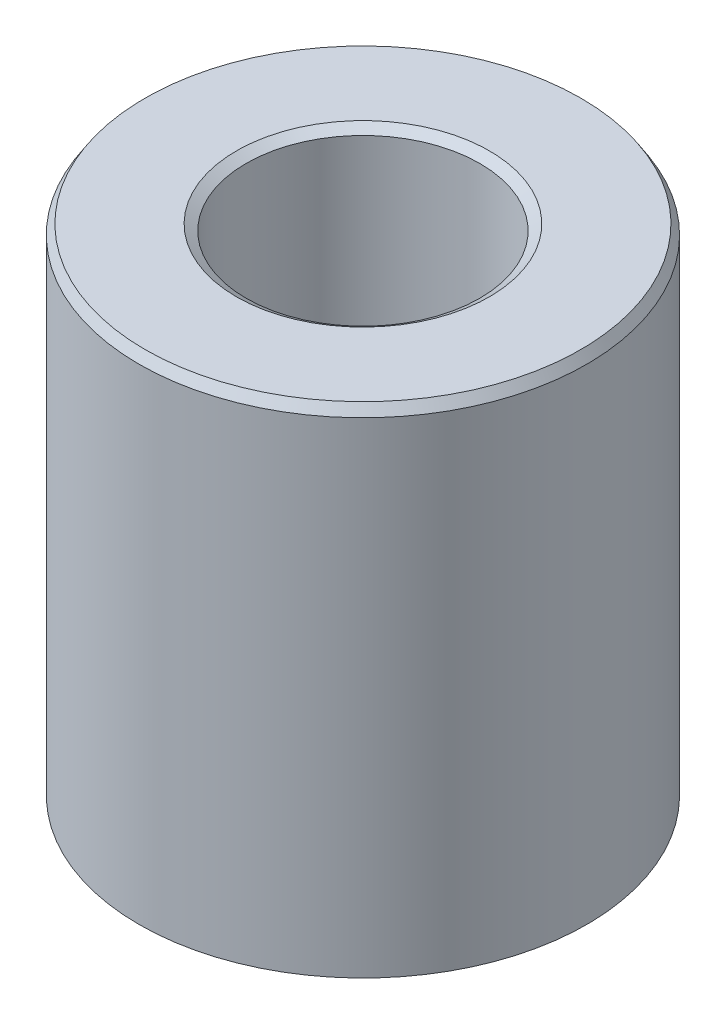
ISO-10303-21;
HEADER;
FILE_DESCRIPTION(('STEP AP214'),'2;1');
FILE_NAME('part.step','',(''),(''),'','','');
FILE_SCHEMA(('AUTOMOTIVE_DESIGN { 1 0 10303 214 1 1 1 1 }'));
ENDSEC;
DATA;
#1=APPLICATION_CONTEXT('core data for automotive mechanical design processes');
#2=APPLICATION_PROTOCOL_DEFINITION('international standard','automotive_design',2000,#1);
#3=PRODUCT_CONTEXT('',#1,'mechanical');
#4=PRODUCT('Part','Part','',(#3));
#5=PRODUCT_RELATED_PRODUCT_CATEGORY('part','',(#4));
#6=PRODUCT_DEFINITION_FORMATION('','',#4);
#7=PRODUCT_DEFINITION_CONTEXT('part definition',#1,'design');
#8=PRODUCT_DEFINITION('design','',#6,#7);
#9=PRODUCT_DEFINITION_SHAPE('','',#8);
#10=(LENGTH_UNIT() NAMED_UNIT(*) SI_UNIT(.MILLI.,.METRE.));
#11=(NAMED_UNIT(*) PLANE_ANGLE_UNIT() SI_UNIT($,.RADIAN.));
#12=(NAMED_UNIT(*) SI_UNIT($,.STERADIAN.) SOLID_ANGLE_UNIT());
#13=UNCERTAINTY_MEASURE_WITH_UNIT(LENGTH_MEASURE(1.E-05),#10,'distance_accuracy_value','');
#14=(GEOMETRIC_REPRESENTATION_CONTEXT(3) GLOBAL_UNCERTAINTY_ASSIGNED_CONTEXT((#13)) GLOBAL_UNIT_ASSIGNED_CONTEXT((#10,
#11,#12)) REPRESENTATION_CONTEXT('',''));
#15=CARTESIAN_POINT('',(0.,0.,0.));
#16=DIRECTION('',(0.,0.,1.));
#17=DIRECTION('',(1.,0.,0.));
#18=AXIS2_PLACEMENT_3D('',#15,#16,#17);
#19=CARTESIAN_POINT('',(0.,111.864383192413,0.));
#20=DIRECTION('',(0.,-1.,0.));
#21=DIRECTION('',(0.,0.,-1.));
#22=AXIS2_PLACEMENT_3D('',#19,#20,#21);
#23=CYLINDRICAL_SURFACE('',#22,50.);
#24=CARTESIAN_POINT('',(0.,1.3553874074811,0.));
#25=DIRECTION('',(0.,1.,0.));
#26=DIRECTION('',(0.,0.,1.));
#27=AXIS2_PLACEMENT_3D('',#24,#25,#26);
#28=CIRCLE('',#27,50.);
#29=CARTESIAN_POINT('',(0.,1.3553874074811,50.));
#30=VERTEX_POINT('',#29);
#31=EDGE_CURVE('E10',#30,#30,#28,.T.);
#32=ORIENTED_EDGE('',*,*,#31,.T.);
#33=EDGE_LOOP('',(#32));
#34=FACE_BOUND('',#33,.T.);
#35=CARTESIAN_POINT('',(0.,109.711032816456,0.));
#36=DIRECTION('',(0.,1.,0.));
#37=DIRECTION('',(0.,0.,1.));
#38=AXIS2_PLACEMENT_3D('',#35,#36,#37);
#39=CIRCLE('',#38,50.);
#40=CARTESIAN_POINT('',(0.,109.711032816456,50.));
#41=VERTEX_POINT('',#40);
#42=EDGE_CURVE('E50',#41,#41,#39,.F.);
#43=ORIENTED_EDGE('',*,*,#42,.T.);
#44=EDGE_LOOP('',(#43));
#45=FACE_BOUND('',#44,.T.);
#46=ADVANCED_FACE('F39',(#34,#45),#23,.T.);
#47=CARTESIAN_POINT('',(0.,111.864383192413,0.));
#48=DIRECTION('',(0.,1.,0.));
#49=DIRECTION('',(0.,0.,1.));
#50=AXIS2_PLACEMENT_3D('',#47,#48,#49);
#51=PLANE('',#50);
#52=CARTESIAN_POINT('',(0.,111.864383192413,0.));
#53=DIRECTION('',(0.,1.,0.));
#54=DIRECTION('',(0.,0.,1.));
#55=AXIS2_PLACEMENT_3D('',#52,#53,#54);
#56=CIRCLE('',#55,28.2431101300914);
#57=CARTESIAN_POINT('',(0.,111.864383192413,28.2431101300914));
#58=VERTEX_POINT('',#57);
#59=EDGE_CURVE('E58',#58,#58,#56,.F.);
#60=ORIENTED_EDGE('',*,*,#59,.T.);
#61=EDGE_LOOP('',(#60));
#62=FACE_BOUND('',#61,.T.);
#63=CARTESIAN_POINT('',(0.,111.864383192413,0.));
#64=DIRECTION('',(0.,1.,0.));
#65=DIRECTION('',(0.,0.,1.));
#66=AXIS2_PLACEMENT_3D('',#63,#64,#65);
#67=CIRCLE('',#66,48.6446125925189);
#68=CARTESIAN_POINT('',(0.,111.864383192413,48.6446125925189));
#69=VERTEX_POINT('',#68);
#70=EDGE_CURVE('E61',#69,#69,#67,.T.);
#71=ORIENTED_EDGE('',*,*,#70,.T.);
#72=EDGE_LOOP('',(#71));
#73=FACE_BOUND('',#72,.T.);
#74=ADVANCED_FACE('F88',(#62,#73),#51,.T.);
#75=CARTESIAN_POINT('',(0.,0.,0.));
#76=DIRECTION('',(0.,1.,0.));
#77=DIRECTION('',(0.,0.,1.));
#78=AXIS2_PLACEMENT_3D('',#75,#76,#77);
#79=PLANE('',#78);
#80=CARTESIAN_POINT('',(0.,0.,0.));
#81=DIRECTION('',(0.,1.,0.));
#82=DIRECTION('',(0.,0.,1.));
#83=AXIS2_PLACEMENT_3D('',#80,#81,#82);
#84=CIRCLE('',#83,27.4451471616161);
#85=CARTESIAN_POINT('',(0.,0.,27.4451471616161));
#86=VERTEX_POINT('',#85);
#87=EDGE_CURVE('E51',#86,#86,#84,.T.);
#88=ORIENTED_EDGE('',*,*,#87,.T.);
#89=EDGE_LOOP('',(#88));
#90=FACE_BOUND('',#89,.T.);
#91=CARTESIAN_POINT('',(0.,0.,0.));
#92=DIRECTION('',(0.,1.,0.));
#93=DIRECTION('',(0.,0.,1.));
#94=AXIS2_PLACEMENT_3D('',#91,#92,#93);
#95=CIRCLE('',#94,47.8466496240437);
#96=CARTESIAN_POINT('',(0.,0.,47.8466496240437));
#97=VERTEX_POINT('',#96);
#98=EDGE_CURVE('E54',#97,#97,#95,.F.);
#99=ORIENTED_EDGE('',*,*,#98,.T.);
#100=EDGE_LOOP('',(#99));
#101=FACE_BOUND('',#100,.T.);
#102=ADVANCED_FACE('F83',(#90,#101),#79,.F.);
#103=CARTESIAN_POINT('',(0.,111.864383192413,0.));
#104=DIRECTION('',(0.,-1.,0.));
#105=DIRECTION('',(0.,0.,-1.));
#106=AXIS2_PLACEMENT_3D('',#103,#104,#105);
#107=CYLINDRICAL_SURFACE('',#106,26.0897597541351);
#108=CARTESIAN_POINT('',(0.,110.508995784931,0.));
#109=DIRECTION('',(0.,1.,0.));
#110=DIRECTION('',(0.,0.,1.));
#111=AXIS2_PLACEMENT_3D('',#108,#109,#110);
#112=CIRCLE('',#111,26.0897597541351);
#113=CARTESIAN_POINT('',(0.,110.508995784931,26.0897597541351));
#114=VERTEX_POINT('',#113);
#115=EDGE_CURVE('E67',#114,#114,#112,.T.);
#116=ORIENTED_EDGE('',*,*,#115,.T.);
#117=EDGE_LOOP('',(#116));
#118=FACE_BOUND('',#117,.T.);
#119=CARTESIAN_POINT('',(0.,2.15335037595631,0.));
#120=DIRECTION('',(0.,1.,0.));
#121=DIRECTION('',(0.,0.,1.));
#122=AXIS2_PLACEMENT_3D('',#119,#120,#121);
#123=CIRCLE('',#122,26.0897597541351);
#124=CARTESIAN_POINT('',(0.,2.15335037595631,26.0897597541351));
#125=VERTEX_POINT('',#124);
#126=EDGE_CURVE('E69',#125,#125,#123,.F.);
#127=ORIENTED_EDGE('',*,*,#126,.T.);
#128=EDGE_LOOP('',(#127));
#129=FACE_BOUND('',#128,.T.);
#130=ADVANCED_FACE('F71',(#118,#129),#107,.F.);
#131=CARTESIAN_POINT('',(0.,110.508995784931,0.));
#132=DIRECTION('',(0.,1.,0.));
#133=DIRECTION('',(0.,0.,1.));
#134=AXIS2_PLACEMENT_3D('',#131,#132,#133);
#135=CONICAL_SURFACE('',#134,26.0897597541351,1.00901637699732);
#136=ORIENTED_EDGE('',*,*,#59,.F.);
#137=EDGE_LOOP('',(#136));
#138=FACE_BOUND('',#137,.T.);
#139=ORIENTED_EDGE('',*,*,#115,.F.);
#140=EDGE_LOOP('',(#139));
#141=FACE_BOUND('',#140,.T.);
#142=ADVANCED_FACE('F77',(#138,#141),#135,.F.);
#143=CARTESIAN_POINT('',(0.,0.,0.));
#144=DIRECTION('',(0.,-1.,0.));
#145=DIRECTION('',(0.,0.,-1.));
#146=AXIS2_PLACEMENT_3D('',#143,#144,#145);
#147=CONICAL_SURFACE('',#146,27.4451471616161,0.561779949797576);
#148=ORIENTED_EDGE('',*,*,#126,.F.);
#149=EDGE_LOOP('',(#148));
#150=FACE_BOUND('',#149,.T.);
#151=ORIENTED_EDGE('',*,*,#87,.F.);
#152=EDGE_LOOP('',(#151));
#153=FACE_BOUND('',#152,.T.);
#154=ADVANCED_FACE('F73',(#150,#153),#147,.F.);
#155=CARTESIAN_POINT('',(0.,1.3553874074811,0.));
#156=DIRECTION('',(0.,1.,0.));
#157=DIRECTION('',(0.,0.,1.));
#158=AXIS2_PLACEMENT_3D('',#155,#156,#157);
#159=CONICAL_SURFACE('',#158,50.,1.00901637699732);
#160=ORIENTED_EDGE('',*,*,#98,.F.);
#161=EDGE_LOOP('',(#160));
#162=FACE_BOUND('',#161,.T.);
#163=ORIENTED_EDGE('',*,*,#31,.F.);
#164=EDGE_LOOP('',(#163));
#165=FACE_BOUND('',#164,.T.);
#166=ADVANCED_FACE('F76',(#162,#165),#159,.T.);
#167=CARTESIAN_POINT('',(0.,111.864383192413,0.));
#168=DIRECTION('',(0.,-1.,0.));
#169=DIRECTION('',(0.,0.,-1.));
#170=AXIS2_PLACEMENT_3D('',#167,#168,#169);
#171=CONICAL_SURFACE('',#170,48.6446125925189,0.561779949797583);
#172=ORIENTED_EDGE('',*,*,#42,.F.);
#173=EDGE_LOOP('',(#172));
#174=FACE_BOUND('',#173,.T.);
#175=ORIENTED_EDGE('',*,*,#70,.F.);
#176=EDGE_LOOP('',(#175));
#177=FACE_BOUND('',#176,.T.);
#178=ADVANCED_FACE('F45',(#174,#177),#171,.T.);
#179=CLOSED_SHELL('',(#46,#74,#102,#130,#142,#154,#166,#178));
#180=MANIFOLD_SOLID_BREP('B2',#179);
#181=ADVANCED_BREP_SHAPE_REPRESENTATION('',(#18,#180),#14);
#182=SHAPE_DEFINITION_REPRESENTATION(#9,#181);
ENDSEC;
END-ISO-10303-21;
